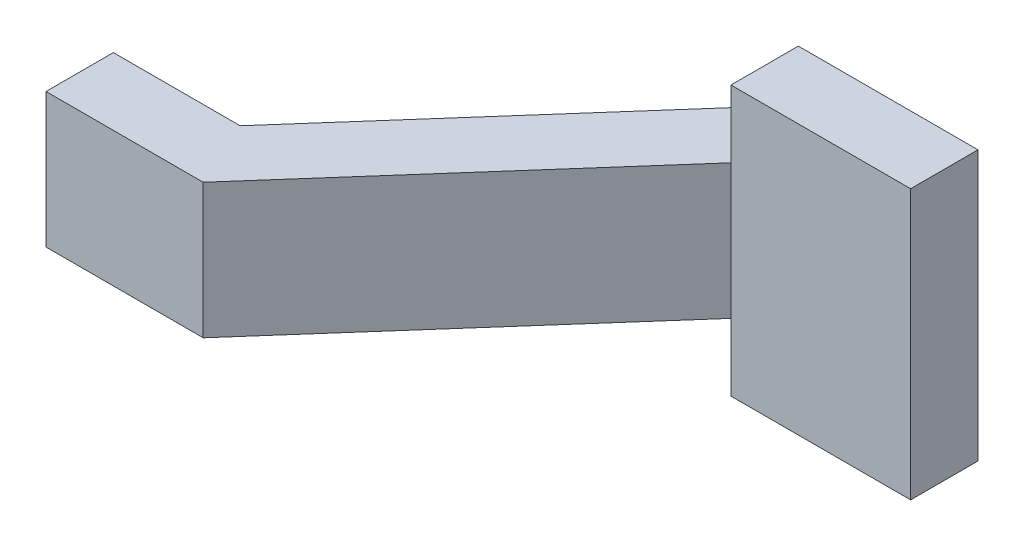
ISO-10303-21;
HEADER;
FILE_DESCRIPTION(('STEP AP214'),'2;1');
FILE_NAME('part.step','',(''),(''),'','','');
FILE_SCHEMA(('AUTOMOTIVE_DESIGN { 1 0 10303 214 1 1 1 1 }'));
ENDSEC;
DATA;
#1=APPLICATION_CONTEXT('core data for automotive mechanical design processes');
#2=APPLICATION_PROTOCOL_DEFINITION('international standard','automotive_design',2000,#1);
#3=PRODUCT_CONTEXT('',#1,'mechanical');
#4=PRODUCT('Part','Part','',(#3));
#5=PRODUCT_RELATED_PRODUCT_CATEGORY('part','',(#4));
#6=PRODUCT_DEFINITION_FORMATION('','',#4);
#7=PRODUCT_DEFINITION_CONTEXT('part definition',#1,'design');
#8=PRODUCT_DEFINITION('design','',#6,#7);
#9=PRODUCT_DEFINITION_SHAPE('','',#8);
#10=(LENGTH_UNIT() NAMED_UNIT(*) SI_UNIT(.MILLI.,.METRE.));
#11=(NAMED_UNIT(*) PLANE_ANGLE_UNIT() SI_UNIT($,.RADIAN.));
#12=(NAMED_UNIT(*) SI_UNIT($,.STERADIAN.) SOLID_ANGLE_UNIT());
#13=UNCERTAINTY_MEASURE_WITH_UNIT(LENGTH_MEASURE(1.E-05),#10,'distance_accuracy_value','');
#14=(GEOMETRIC_REPRESENTATION_CONTEXT(3) GLOBAL_UNCERTAINTY_ASSIGNED_CONTEXT((#13)) GLOBAL_UNIT_ASSIGNED_CONTEXT((#10,
#11,#12)) REPRESENTATION_CONTEXT('',''));
#15=CARTESIAN_POINT('',(0.,0.,0.));
#16=DIRECTION('',(0.,0.,1.));
#17=DIRECTION('',(1.,0.,0.));
#18=AXIS2_PLACEMENT_3D('',#15,#16,#17);
#19=CARTESIAN_POINT('',(0.,0.762,0.));
#20=DIRECTION('',(1.,0.,0.));
#21=DIRECTION('',(0.,0.,-1.));
#22=AXIS2_PLACEMENT_3D('',#19,#20,#21);
#23=PLANE('',#22);
#24=DIRECTION('',(0.,0.,-1.));
#25=VECTOR('',#24,1.);
#26=CARTESIAN_POINT('',(0.,-0.381,0.));
#27=LINE('',#26,#25);
#28=CARTESIAN_POINT('',(0.,-0.381,0.));
#29=VERTEX_POINT('',#28);
#30=CARTESIAN_POINT('',(0.,-0.381,-0.381));
#31=VERTEX_POINT('',#30);
#32=EDGE_CURVE('E128',#29,#31,#27,.T.);
#33=ORIENTED_EDGE('',*,*,#32,.F.);
#34=DIRECTION('',(0.,-1.,0.));
#35=VECTOR('',#34,1.);
#36=CARTESIAN_POINT('',(0.,0.762,0.));
#37=LINE('',#36,#35);
#38=CARTESIAN_POINT('',(0.,0.381,0.));
#39=VERTEX_POINT('',#38);
#40=EDGE_CURVE('E142',#39,#29,#37,.T.);
#41=ORIENTED_EDGE('',*,*,#40,.F.);
#42=DIRECTION('',(0.,0.,-1.));
#43=VECTOR('',#42,1.);
#44=CARTESIAN_POINT('',(0.,0.381,0.));
#45=LINE('',#44,#43);
#46=CARTESIAN_POINT('',(0.,0.381,-0.381));
#47=VERTEX_POINT('',#46);
#48=EDGE_CURVE('E211',#39,#47,#45,.T.);
#49=ORIENTED_EDGE('',*,*,#48,.T.);
#50=DIRECTION('',(0.,-1.,0.));
#51=VECTOR('',#50,1.);
#52=CARTESIAN_POINT('',(0.,0.762,-0.381));
#53=LINE('',#52,#51);
#54=EDGE_CURVE('E144',#47,#31,#53,.T.);
#55=ORIENTED_EDGE('',*,*,#54,.T.);
#56=EDGE_LOOP('',(#33,#41,#49,#55));
#57=FACE_BOUND('',#56,.T.);
#58=ADVANCED_FACE('F34',(#57),#23,.F.);
#59=CARTESIAN_POINT('',(0.,0.762,0.));
#60=DIRECTION('',(0.,0.,-1.));
#61=DIRECTION('',(-1.,0.,0.));
#62=AXIS2_PLACEMENT_3D('',#59,#60,#61);
#63=PLANE('',#62);
#64=DIRECTION('',(-1.,0.,0.));
#65=VECTOR('',#64,1.);
#66=CARTESIAN_POINT('',(0.,-0.381,0.));
#67=LINE('',#66,#65);
#68=CARTESIAN_POINT('',(0.888999999999999,-0.381,0.));
#69=VERTEX_POINT('',#68);
#70=EDGE_CURVE('E125',#69,#29,#67,.T.);
#71=ORIENTED_EDGE('',*,*,#70,.F.);
#72=DIRECTION('',(0.,-1.,0.));
#73=VECTOR('',#72,1.);
#74=CARTESIAN_POINT('',(0.889,0.762,0.));
#75=LINE('',#74,#73);
#76=CARTESIAN_POINT('',(0.889,0.381,0.));
#77=VERTEX_POINT('',#76);
#78=EDGE_CURVE('E151',#77,#69,#75,.T.);
#79=ORIENTED_EDGE('',*,*,#78,.F.);
#80=DIRECTION('',(-1.,0.,0.));
#81=VECTOR('',#80,1.);
#82=CARTESIAN_POINT('',(0.,0.381,0.));
#83=LINE('',#82,#81);
#84=EDGE_CURVE('E149',#77,#39,#83,.T.);
#85=ORIENTED_EDGE('',*,*,#84,.T.);
#86=ORIENTED_EDGE('',*,*,#40,.T.);
#87=EDGE_LOOP('',(#71,#79,#85,#86));
#88=FACE_BOUND('',#87,.T.);
#89=ADVANCED_FACE('F148',(#88),#63,.F.);
#90=CARTESIAN_POINT('',(0.889,0.762,0.));
#91=DIRECTION('',(-0.750713516922755,0.,-0.660627894892025));
#92=DIRECTION('',(-0.660627894892025,0.,0.750713516922755));
#93=AXIS2_PLACEMENT_3D('',#90,#91,#92);
#94=PLANE('',#93);
#95=DIRECTION('',(-0.660627894892025,0.,0.750713516922755));
#96=VECTOR('',#95,1.);
#97=CARTESIAN_POINT('',(0.889,-0.381,0.));
#98=LINE('',#97,#96);
#99=CARTESIAN_POINT('',(2.286,-0.381,-1.5875));
#100=VERTEX_POINT('',#99);
#101=EDGE_CURVE('E132',#100,#69,#98,.T.);
#102=ORIENTED_EDGE('',*,*,#101,.F.);
#103=DIRECTION('',(0.,-1.,0.));
#104=VECTOR('',#103,1.);
#105=CARTESIAN_POINT('',(2.286,0.762,-1.5875));
#106=LINE('',#105,#104);
#107=CARTESIAN_POINT('',(2.286,0.381,-1.5875));
#108=VERTEX_POINT('',#107);
#109=EDGE_CURVE('E188',#108,#100,#106,.T.);
#110=ORIENTED_EDGE('',*,*,#109,.F.);
#111=DIRECTION('',(-0.660627894892025,0.,0.750713516922755));
#112=VECTOR('',#111,1.);
#113=CARTESIAN_POINT('',(0.889,0.381,0.));
#114=LINE('',#113,#112);
#115=EDGE_CURVE('E198',#108,#77,#114,.T.);
#116=ORIENTED_EDGE('',*,*,#115,.T.);
#117=ORIENTED_EDGE('',*,*,#78,.T.);
#118=EDGE_LOOP('',(#102,#110,#116,#117));
#119=FACE_BOUND('',#118,.T.);
#120=ADVANCED_FACE('F197',(#119),#94,.F.);
#121=CARTESIAN_POINT('',(3.302,0.762,-1.9685));
#122=DIRECTION('',(0.,0.,1.));
#123=DIRECTION('',(1.,0.,0.));
#124=AXIS2_PLACEMENT_3D('',#121,#122,#123);
#125=PLANE('',#124);
#126=DIRECTION('',(0.,1.,0.));
#127=VECTOR('',#126,1.);
#128=CARTESIAN_POINT('',(2.286,-0.762,-1.9685));
#129=LINE('',#128,#127);
#130=CARTESIAN_POINT('',(2.286,-0.762,-1.9685));
#131=VERTEX_POINT('',#130);
#132=CARTESIAN_POINT('',(2.286,-0.381,-1.9685));
#133=VERTEX_POINT('',#132);
#134=EDGE_CURVE('E48',#131,#133,#129,.T.);
#135=ORIENTED_EDGE('',*,*,#134,.T.);
#136=DIRECTION('',(-1.,0.,0.));
#137=VECTOR('',#136,1.);
#138=CARTESIAN_POINT('',(0.,-0.381,-1.9685));
#139=LINE('',#138,#137);
#140=CARTESIAN_POINT('',(2.11376282945303,-0.381,-1.9685));
#141=VERTEX_POINT('',#140);
#142=EDGE_CURVE('E235',#133,#141,#139,.T.);
#143=ORIENTED_EDGE('',*,*,#142,.T.);
#144=DIRECTION('',(0.,-1.,0.));
#145=VECTOR('',#144,1.);
#146=CARTESIAN_POINT('',(2.11376282945303,0.762,-1.9685));
#147=LINE('',#146,#145);
#148=CARTESIAN_POINT('',(2.11376282945303,0.381,-1.9685));
#149=VERTEX_POINT('',#148);
#150=EDGE_CURVE('E183',#149,#141,#147,.T.);
#151=ORIENTED_EDGE('',*,*,#150,.F.);
#152=DIRECTION('',(-1.,0.,0.));
#153=VECTOR('',#152,1.);
#154=CARTESIAN_POINT('',(0.,0.381,-1.9685));
#155=LINE('',#154,#153);
#156=CARTESIAN_POINT('',(2.286,0.381,-1.9685));
#157=VERTEX_POINT('',#156);
#158=EDGE_CURVE('E203',#157,#149,#155,.T.);
#159=ORIENTED_EDGE('',*,*,#158,.F.);
#160=DIRECTION('',(0.,-1.,0.));
#161=VECTOR('',#160,1.);
#162=CARTESIAN_POINT('',(2.286,0.762,-1.9685));
#163=LINE('',#162,#161);
#164=CARTESIAN_POINT('',(2.286,0.762,-1.9685));
#165=VERTEX_POINT('',#164);
#166=EDGE_CURVE('E199',#165,#157,#163,.T.);
#167=ORIENTED_EDGE('',*,*,#166,.F.);
#168=DIRECTION('',(-1.,0.,0.));
#169=VECTOR('',#168,1.);
#170=CARTESIAN_POINT('',(3.302,0.762,-1.9685));
#171=LINE('',#170,#169);
#172=CARTESIAN_POINT('',(3.302,0.762,-1.9685));
#173=VERTEX_POINT('',#172);
#174=EDGE_CURVE('E180',#173,#165,#171,.T.);
#175=ORIENTED_EDGE('',*,*,#174,.F.);
#176=DIRECTION('',(0.,-1.,0.));
#177=VECTOR('',#176,1.);
#178=CARTESIAN_POINT('',(3.302,0.762,-1.9685));
#179=LINE('',#178,#177);
#180=CARTESIAN_POINT('',(3.302,-0.762,-1.9685));
#181=VERTEX_POINT('',#180);
#182=EDGE_CURVE('E171',#173,#181,#179,.T.);
#183=ORIENTED_EDGE('',*,*,#182,.T.);
#184=DIRECTION('',(-1.,0.,0.));
#185=VECTOR('',#184,1.);
#186=CARTESIAN_POINT('',(3.302,-0.762,-1.9685));
#187=LINE('',#186,#185);
#188=EDGE_CURVE('E164',#181,#131,#187,.T.);
#189=ORIENTED_EDGE('',*,*,#188,.T.);
#190=EDGE_LOOP('',(#135,#143,#151,#159,#167,#175,#183,#189));
#191=FACE_BOUND('',#190,.T.);
#192=ADVANCED_FACE('F168',(#191),#125,.F.);
#193=CARTESIAN_POINT('',(0.716762829453032,0.762,-0.381));
#194=DIRECTION('',(0.750713516922755,0.,0.660627894892025));
#195=DIRECTION('',(0.660627894892025,0.,-0.750713516922755));
#196=AXIS2_PLACEMENT_3D('',#193,#194,#195);
#197=PLANE('',#196);
#198=DIRECTION('',(0.660627894892025,0.,-0.750713516922755));
#199=VECTOR('',#198,1.);
#200=CARTESIAN_POINT('',(0.716762829453032,-0.381,-0.381));
#201=LINE('',#200,#199);
#202=CARTESIAN_POINT('',(0.716762829453032,-0.381,-0.381));
#203=VERTEX_POINT('',#202);
#204=EDGE_CURVE('E200',#203,#141,#201,.T.);
#205=ORIENTED_EDGE('',*,*,#204,.F.);
#206=DIRECTION('',(0.,-1.,0.));
#207=VECTOR('',#206,1.);
#208=CARTESIAN_POINT('',(0.716762829453032,0.762,-0.381));
#209=LINE('',#208,#207);
#210=CARTESIAN_POINT('',(0.716762829453032,0.381,-0.381));
#211=VERTEX_POINT('',#210);
#212=EDGE_CURVE('E179',#211,#203,#209,.T.);
#213=ORIENTED_EDGE('',*,*,#212,.F.);
#214=DIRECTION('',(0.660627894892025,0.,-0.750713516922755));
#215=VECTOR('',#214,1.);
#216=CARTESIAN_POINT('',(0.716762829453032,0.381,-0.381));
#217=LINE('',#216,#215);
#218=EDGE_CURVE('E213',#211,#149,#217,.T.);
#219=ORIENTED_EDGE('',*,*,#218,.T.);
#220=ORIENTED_EDGE('',*,*,#150,.T.);
#221=EDGE_LOOP('',(#205,#213,#219,#220));
#222=FACE_BOUND('',#221,.T.);
#223=ADVANCED_FACE('F231',(#222),#197,.F.);
#224=CARTESIAN_POINT('',(0.,0.762,-0.381));
#225=DIRECTION('',(0.,0.,1.));
#226=DIRECTION('',(1.,0.,0.));
#227=AXIS2_PLACEMENT_3D('',#224,#225,#226);
#228=PLANE('',#227);
#229=DIRECTION('',(1.,0.,0.));
#230=VECTOR('',#229,1.);
#231=CARTESIAN_POINT('',(0.,-0.381,-0.381));
#232=LINE('',#231,#230);
#233=EDGE_CURVE('E11',#31,#203,#232,.T.);
#234=ORIENTED_EDGE('',*,*,#233,.F.);
#235=ORIENTED_EDGE('',*,*,#54,.F.);
#236=DIRECTION('',(1.,0.,0.));
#237=VECTOR('',#236,1.);
#238=CARTESIAN_POINT('',(0.,0.381,-0.381));
#239=LINE('',#238,#237);
#240=EDGE_CURVE('E153',#47,#211,#239,.T.);
#241=ORIENTED_EDGE('',*,*,#240,.T.);
#242=ORIENTED_EDGE('',*,*,#212,.T.);
#243=EDGE_LOOP('',(#234,#235,#241,#242));
#244=FACE_BOUND('',#243,.T.);
#245=ADVANCED_FACE('F233',(#244),#228,.F.);
#246=CARTESIAN_POINT('',(0.,-0.762,0.));
#247=DIRECTION('',(0.,-1.,0.));
#248=DIRECTION('',(0.,0.,-1.));
#249=AXIS2_PLACEMENT_3D('',#246,#247,#248);
#250=PLANE('',#249);
#251=DIRECTION('',(1.,0.,0.));
#252=VECTOR('',#251,1.);
#253=CARTESIAN_POINT('',(2.286,-0.762,-1.5875));
#254=LINE('',#253,#252);
#255=CARTESIAN_POINT('',(2.286,-0.762,-1.5875));
#256=VERTEX_POINT('',#255);
#257=CARTESIAN_POINT('',(3.302,-0.762,-1.5875));
#258=VERTEX_POINT('',#257);
#259=EDGE_CURVE('E165',#256,#258,#254,.T.);
#260=ORIENTED_EDGE('',*,*,#259,.F.);
#261=DIRECTION('',(0.,0.,-1.));
#262=VECTOR('',#261,1.);
#263=CARTESIAN_POINT('',(2.286,-0.762,0.));
#264=LINE('',#263,#262);
#265=EDGE_CURVE('E41',#256,#131,#264,.T.);
#266=ORIENTED_EDGE('',*,*,#265,.T.);
#267=ORIENTED_EDGE('',*,*,#188,.F.);
#268=DIRECTION('',(0.,0.,-1.));
#269=VECTOR('',#268,1.);
#270=CARTESIAN_POINT('',(3.302,-0.762,-1.5875));
#271=LINE('',#270,#269);
#272=EDGE_CURVE('E71',#258,#181,#271,.T.);
#273=ORIENTED_EDGE('',*,*,#272,.F.);
#274=EDGE_LOOP('',(#260,#266,#267,#273));
#275=FACE_BOUND('',#274,.T.);
#276=ADVANCED_FACE('F163',(#275),#250,.T.);
#277=CARTESIAN_POINT('',(2.286,0.762,-1.5875));
#278=DIRECTION('',(0.,0.,-1.));
#279=DIRECTION('',(-1.,0.,0.));
#280=AXIS2_PLACEMENT_3D('',#277,#278,#279);
#281=PLANE('',#280);
#282=ORIENTED_EDGE('',*,*,#259,.T.);
#283=DIRECTION('',(0.,-1.,0.));
#284=VECTOR('',#283,1.);
#285=CARTESIAN_POINT('',(3.302,0.762,-1.5875));
#286=LINE('',#285,#284);
#287=CARTESIAN_POINT('',(3.302,0.762,-1.5875));
#288=VERTEX_POINT('',#287);
#289=EDGE_CURVE('E187',#288,#258,#286,.T.);
#290=ORIENTED_EDGE('',*,*,#289,.F.);
#291=DIRECTION('',(1.,0.,0.));
#292=VECTOR('',#291,1.);
#293=CARTESIAN_POINT('',(2.286,0.762,-1.5875));
#294=LINE('',#293,#292);
#295=CARTESIAN_POINT('',(2.286,0.762,-1.5875));
#296=VERTEX_POINT('',#295);
#297=EDGE_CURVE('E172',#296,#288,#294,.T.);
#298=ORIENTED_EDGE('',*,*,#297,.F.);
#299=EDGE_CURVE('E78',#296,#108,#106,.T.);
#300=ORIENTED_EDGE('',*,*,#299,.T.);
#301=ORIENTED_EDGE('',*,*,#109,.T.);
#302=DIRECTION('',(0.,1.,0.));
#303=VECTOR('',#302,1.);
#304=CARTESIAN_POINT('',(2.286,0.762,-1.5875));
#305=LINE('',#304,#303);
#306=EDGE_CURVE('E194',#256,#100,#305,.T.);
#307=ORIENTED_EDGE('',*,*,#306,.F.);
#308=EDGE_LOOP('',(#282,#290,#298,#300,#301,#307));
#309=FACE_BOUND('',#308,.T.);
#310=ADVANCED_FACE('F193',(#309),#281,.F.);
#311=CARTESIAN_POINT('',(3.302,0.762,-1.5875));
#312=DIRECTION('',(-1.,0.,0.));
#313=DIRECTION('',(0.,0.,1.));
#314=AXIS2_PLACEMENT_3D('',#311,#312,#313);
#315=PLANE('',#314);
#316=ORIENTED_EDGE('',*,*,#272,.T.);
#317=ORIENTED_EDGE('',*,*,#182,.F.);
#318=DIRECTION('',(0.,0.,-1.));
#319=VECTOR('',#318,1.);
#320=CARTESIAN_POINT('',(3.302,0.762,-1.5875));
#321=LINE('',#320,#319);
#322=EDGE_CURVE('E57',#288,#173,#321,.T.);
#323=ORIENTED_EDGE('',*,*,#322,.F.);
#324=ORIENTED_EDGE('',*,*,#289,.T.);
#325=EDGE_LOOP('',(#316,#317,#323,#324));
#326=FACE_BOUND('',#325,.T.);
#327=ADVANCED_FACE('F220',(#326),#315,.F.);
#328=CARTESIAN_POINT('',(0.,0.762,0.));
#329=DIRECTION('',(0.,-1.,0.));
#330=DIRECTION('',(0.,0.,-1.));
#331=AXIS2_PLACEMENT_3D('',#328,#329,#330);
#332=PLANE('',#331);
#333=ORIENTED_EDGE('',*,*,#174,.T.);
#334=DIRECTION('',(0.,0.,1.));
#335=VECTOR('',#334,1.);
#336=CARTESIAN_POINT('',(2.286,0.762,0.));
#337=LINE('',#336,#335);
#338=EDGE_CURVE('E150',#165,#296,#337,.T.);
#339=ORIENTED_EDGE('',*,*,#338,.T.);
#340=ORIENTED_EDGE('',*,*,#297,.T.);
#341=ORIENTED_EDGE('',*,*,#322,.T.);
#342=EDGE_LOOP('',(#333,#339,#340,#341));
#343=FACE_BOUND('',#342,.T.);
#344=ADVANCED_FACE('F223',(#343),#332,.F.);
#345=CARTESIAN_POINT('',(0.,0.381,0.));
#346=DIRECTION('',(0.,-1.,0.));
#347=DIRECTION('',(1.,0.,0.));
#348=AXIS2_PLACEMENT_3D('',#345,#346,#347);
#349=PLANE('',#348);
#350=DIRECTION('',(0.,0.,-1.));
#351=VECTOR('',#350,1.);
#352=CARTESIAN_POINT('',(2.286,0.381,0.));
#353=LINE('',#352,#351);
#354=EDGE_CURVE('E208',#108,#157,#353,.T.);
#355=ORIENTED_EDGE('',*,*,#354,.T.);
#356=ORIENTED_EDGE('',*,*,#158,.T.);
#357=ORIENTED_EDGE('',*,*,#218,.F.);
#358=ORIENTED_EDGE('',*,*,#240,.F.);
#359=ORIENTED_EDGE('',*,*,#48,.F.);
#360=ORIENTED_EDGE('',*,*,#84,.F.);
#361=ORIENTED_EDGE('',*,*,#115,.F.);
#362=EDGE_LOOP('',(#355,#356,#357,#358,#359,#360,#361));
#363=FACE_BOUND('',#362,.T.);
#364=ADVANCED_FACE('F227',(#363),#349,.F.);
#365=CARTESIAN_POINT('',(2.286,0.762,0.));
#366=DIRECTION('',(1.,0.,0.));
#367=DIRECTION('',(0.,0.,-1.));
#368=AXIS2_PLACEMENT_3D('',#365,#366,#367);
#369=PLANE('',#368);
#370=ORIENTED_EDGE('',*,*,#338,.F.);
#371=ORIENTED_EDGE('',*,*,#166,.T.);
#372=ORIENTED_EDGE('',*,*,#354,.F.);
#373=ORIENTED_EDGE('',*,*,#299,.F.);
#374=EDGE_LOOP('',(#370,#371,#372,#373));
#375=FACE_BOUND('',#374,.T.);
#376=ADVANCED_FACE('F224',(#375),#369,.F.);
#377=CARTESIAN_POINT('',(0.,-0.381,0.));
#378=DIRECTION('',(0.,-1.,0.));
#379=DIRECTION('',(1.,0.,0.));
#380=AXIS2_PLACEMENT_3D('',#377,#378,#379);
#381=PLANE('',#380);
#382=ORIENTED_EDGE('',*,*,#101,.T.);
#383=ORIENTED_EDGE('',*,*,#70,.T.);
#384=ORIENTED_EDGE('',*,*,#32,.T.);
#385=ORIENTED_EDGE('',*,*,#233,.T.);
#386=ORIENTED_EDGE('',*,*,#204,.T.);
#387=ORIENTED_EDGE('',*,*,#142,.F.);
#388=DIRECTION('',(0.,0.,-1.));
#389=VECTOR('',#388,1.);
#390=CARTESIAN_POINT('',(2.286,-0.381,0.));
#391=LINE('',#390,#389);
#392=EDGE_CURVE('E145',#100,#133,#391,.T.);
#393=ORIENTED_EDGE('',*,*,#392,.F.);
#394=EDGE_LOOP('',(#382,#383,#384,#385,#386,#387,#393));
#395=FACE_BOUND('',#394,.T.);
#396=ADVANCED_FACE('F127',(#395),#381,.T.);
#397=CARTESIAN_POINT('',(2.286,-0.762,0.));
#398=DIRECTION('',(-1.,0.,0.));
#399=DIRECTION('',(0.,0.,1.));
#400=AXIS2_PLACEMENT_3D('',#397,#398,#399);
#401=PLANE('',#400);
#402=ORIENTED_EDGE('',*,*,#306,.T.);
#403=ORIENTED_EDGE('',*,*,#392,.T.);
#404=ORIENTED_EDGE('',*,*,#134,.F.);
#405=ORIENTED_EDGE('',*,*,#265,.F.);
#406=EDGE_LOOP('',(#402,#403,#404,#405));
#407=FACE_BOUND('',#406,.T.);
#408=ADVANCED_FACE('F239',(#407),#401,.T.);
#409=CLOSED_SHELL('',(#58,#89,#120,#192,#223,#245,#276,#310,#327,#344,#364,#376,#396,#408));
#410=MANIFOLD_SOLID_BREP('B2',#409);
#411=ADVANCED_BREP_SHAPE_REPRESENTATION('',(#18,#410),#14);
#412=SHAPE_DEFINITION_REPRESENTATION(#9,#411);
ENDSEC;
END-ISO-10303-21;
